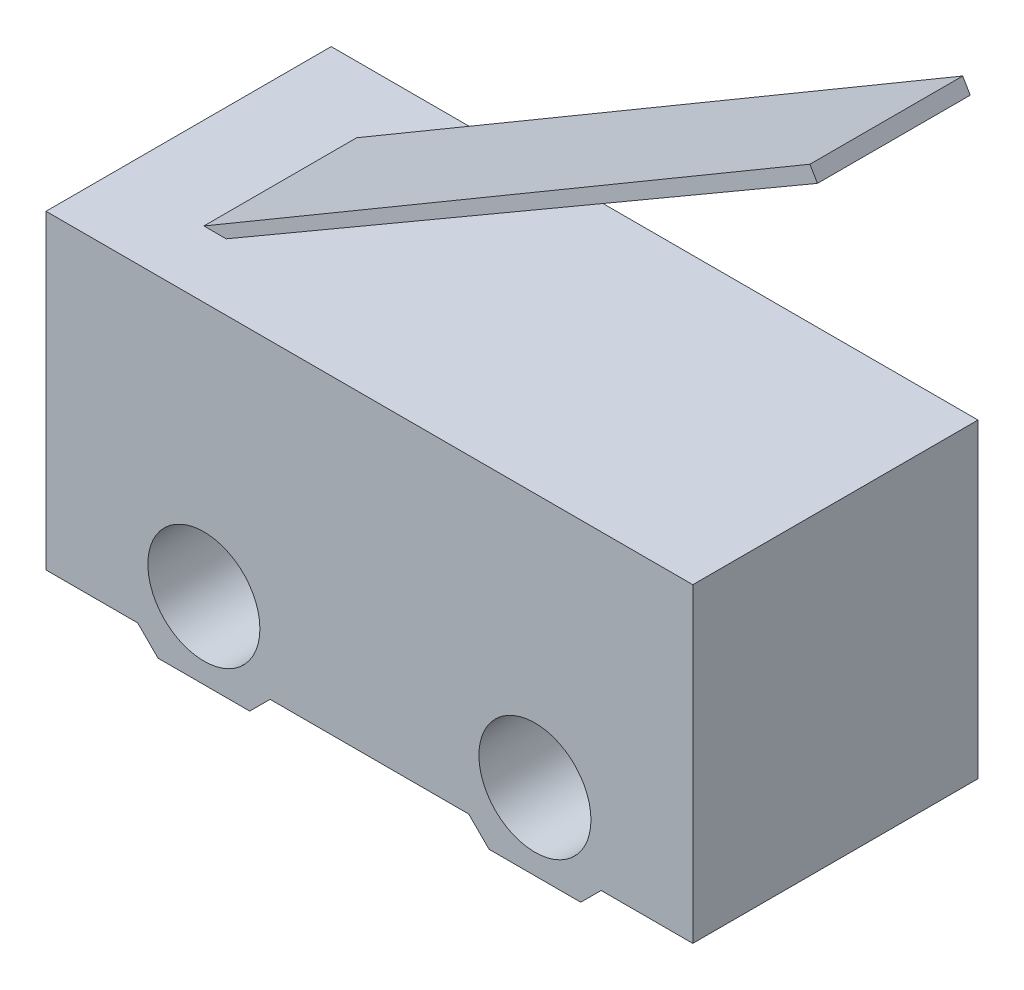
ISO-10303-21;
HEADER;
FILE_DESCRIPTION(('STEP AP214'),'2;1');
FILE_NAME('part.step','',(''),(''),'','','');
FILE_SCHEMA(('AUTOMOTIVE_DESIGN { 1 0 10303 214 1 1 1 1 }'));
ENDSEC;
DATA;
#1=APPLICATION_CONTEXT('core data for automotive mechanical design processes');
#2=APPLICATION_PROTOCOL_DEFINITION('international standard','automotive_design',2000,#1);
#3=PRODUCT_CONTEXT('',#1,'mechanical');
#4=PRODUCT('Part','Part','',(#3));
#5=PRODUCT_RELATED_PRODUCT_CATEGORY('part','',(#4));
#6=PRODUCT_DEFINITION_FORMATION('','',#4);
#7=PRODUCT_DEFINITION_CONTEXT('part definition',#1,'design');
#8=PRODUCT_DEFINITION('design','',#6,#7);
#9=PRODUCT_DEFINITION_SHAPE('','',#8);
#10=(LENGTH_UNIT() NAMED_UNIT(*) SI_UNIT(.MILLI.,.METRE.));
#11=(NAMED_UNIT(*) PLANE_ANGLE_UNIT() SI_UNIT($,.RADIAN.));
#12=(NAMED_UNIT(*) SI_UNIT($,.STERADIAN.) SOLID_ANGLE_UNIT());
#13=UNCERTAINTY_MEASURE_WITH_UNIT(LENGTH_MEASURE(1.E-05),#10,'distance_accuracy_value','');
#14=(GEOMETRIC_REPRESENTATION_CONTEXT(3) GLOBAL_UNCERTAINTY_ASSIGNED_CONTEXT((#13)) GLOBAL_UNIT_ASSIGNED_CONTEXT((#10,
#11,#12)) REPRESENTATION_CONTEXT('',''));
#15=CARTESIAN_POINT('',(0.,0.,0.));
#16=DIRECTION('',(0.,0.,1.));
#17=DIRECTION('',(1.,0.,0.));
#18=AXIS2_PLACEMENT_3D('',#15,#16,#17);
#19=CARTESIAN_POINT('',(0.,6.5,5.6));
#20=DIRECTION('',(0.,-1.,0.));
#21=DIRECTION('',(0.,0.,-1.));
#22=AXIS2_PLACEMENT_3D('',#19,#20,#21);
#23=PLANE('',#22);
#24=DIRECTION('',(-1.,0.,0.));
#25=VECTOR('',#24,1.);
#26=CARTESIAN_POINT('',(0.,6.5,0.));
#27=LINE('',#26,#25);
#28=CARTESIAN_POINT('',(12.7,6.5,0.));
#29=VERTEX_POINT('',#28);
#30=CARTESIAN_POINT('',(0.,6.5,0.));
#31=VERTEX_POINT('',#30);
#32=EDGE_CURVE('E223',#29,#31,#27,.T.);
#33=ORIENTED_EDGE('',*,*,#32,.T.);
#34=DIRECTION('',(0.,0.,-1.));
#35=VECTOR('',#34,1.);
#36=CARTESIAN_POINT('',(0.,6.5,5.6));
#37=LINE('',#36,#35);
#38=CARTESIAN_POINT('',(0.,6.5,5.6));
#39=VERTEX_POINT('',#38);
#40=EDGE_CURVE('E193',#39,#31,#37,.T.);
#41=ORIENTED_EDGE('',*,*,#40,.F.);
#42=DIRECTION('',(-1.,0.,0.));
#43=VECTOR('',#42,1.);
#44=CARTESIAN_POINT('',(0.,6.5,5.6));
#45=LINE('',#44,#43);
#46=CARTESIAN_POINT('',(12.7,6.5,5.6));
#47=VERTEX_POINT('',#46);
#48=EDGE_CURVE('E503',#47,#39,#45,.T.);
#49=ORIENTED_EDGE('',*,*,#48,.F.);
#50=DIRECTION('',(0.,0.,-1.));
#51=VECTOR('',#50,1.);
#52=CARTESIAN_POINT('',(12.7,6.5,5.6));
#53=LINE('',#52,#51);
#54=EDGE_CURVE('E197',#47,#29,#53,.T.);
#55=ORIENTED_EDGE('',*,*,#54,.T.);
#56=EDGE_LOOP('',(#33,#41,#49,#55));
#57=FACE_BOUND('',#56,.T.);
#58=DIRECTION('',(1.,0.,0.));
#59=VECTOR('',#58,1.);
#60=CARTESIAN_POINT('',(2.2382876574409,6.5,4.3));
#61=LINE('',#60,#59);
#62=CARTESIAN_POINT('',(1.8,6.5,4.3));
#63=VERTEX_POINT('',#62);
#64=CARTESIAN_POINT('',(2.2382876574409,6.5,4.3));
#65=VERTEX_POINT('',#64);
#66=EDGE_CURVE('E467',#63,#65,#61,.T.);
#67=ORIENTED_EDGE('',*,*,#66,.F.);
#68=DIRECTION('',(0.,0.,-1.));
#69=VECTOR('',#68,1.);
#70=CARTESIAN_POINT('',(1.8,6.5,4.3));
#71=LINE('',#70,#69);
#72=CARTESIAN_POINT('',(1.8,6.5,1.3));
#73=VERTEX_POINT('',#72);
#74=EDGE_CURVE('E465',#63,#73,#71,.T.);
#75=ORIENTED_EDGE('',*,*,#74,.T.);
#76=DIRECTION('',(1.,0.,0.));
#77=VECTOR('',#76,1.);
#78=CARTESIAN_POINT('',(2.2382876574409,6.5,1.3));
#79=LINE('',#78,#77);
#80=CARTESIAN_POINT('',(2.2382876574409,6.5,1.3));
#81=VERTEX_POINT('',#80);
#82=EDGE_CURVE('E453',#73,#81,#79,.T.);
#83=ORIENTED_EDGE('',*,*,#82,.T.);
#84=DIRECTION('',(0.,0.,-1.));
#85=VECTOR('',#84,1.);
#86=CARTESIAN_POINT('',(2.2382876574409,6.5,4.3));
#87=LINE('',#86,#85);
#88=EDGE_CURVE('E57',#65,#81,#87,.T.);
#89=ORIENTED_EDGE('',*,*,#88,.F.);
#90=EDGE_LOOP('',(#67,#75,#83,#89));
#91=FACE_BOUND('',#90,.T.);
#92=ADVANCED_FACE('F41',(#57,#91),#23,.F.);
#93=CARTESIAN_POINT('',(5.24999999999994,-5.25,5.6));
#94=DIRECTION('',(0.707106781186544,-0.707106781186552,0.));
#95=DIRECTION('',(0.707106781186552,0.707106781186544,0.));
#96=AXIS2_PLACEMENT_3D('',#93,#94,#95);
#97=PLANE('',#96);
#98=DIRECTION('',(-0.707106781186552,-0.707106781186544,0.));
#99=VECTOR('',#98,1.);
#100=CARTESIAN_POINT('',(5.24999999999994,-5.25,0.));
#101=LINE('',#100,#99);
#102=CARTESIAN_POINT('',(10.9,0.4,0.));
#103=VERTEX_POINT('',#102);
#104=CARTESIAN_POINT('',(10.5,0.,0.));
#105=VERTEX_POINT('',#104);
#106=EDGE_CURVE('E219',#103,#105,#101,.T.);
#107=ORIENTED_EDGE('',*,*,#106,.F.);
#108=DIRECTION('',(0.,0.,-1.));
#109=VECTOR('',#108,1.);
#110=CARTESIAN_POINT('',(10.9,0.4,5.6));
#111=LINE('',#110,#109);
#112=CARTESIAN_POINT('',(10.9,0.4,5.6));
#113=VERTEX_POINT('',#112);
#114=EDGE_CURVE('E11',#113,#103,#111,.T.);
#115=ORIENTED_EDGE('',*,*,#114,.F.);
#116=DIRECTION('',(-0.707106781186552,-0.707106781186544,0.));
#117=VECTOR('',#116,1.);
#118=CARTESIAN_POINT('',(5.24999999999994,-5.25,5.6));
#119=LINE('',#118,#117);
#120=CARTESIAN_POINT('',(10.5,0.,5.6));
#121=VERTEX_POINT('',#120);
#122=EDGE_CURVE('E495',#113,#121,#119,.T.);
#123=ORIENTED_EDGE('',*,*,#122,.T.);
#124=DIRECTION('',(0.,0.,-1.));
#125=VECTOR('',#124,1.);
#126=CARTESIAN_POINT('',(10.5,0.,5.6));
#127=LINE('',#126,#125);
#128=EDGE_CURVE('E110',#121,#105,#127,.T.);
#129=ORIENTED_EDGE('',*,*,#128,.T.);
#130=EDGE_LOOP('',(#107,#115,#123,#129));
#131=FACE_BOUND('',#130,.T.);
#132=ADVANCED_FACE('F286',(#131),#97,.T.);
#133=CARTESIAN_POINT('',(0.,0.4,5.6));
#134=DIRECTION('',(0.,1.,0.));
#135=DIRECTION('',(-1.,0.,0.));
#136=AXIS2_PLACEMENT_3D('',#133,#134,#135);
#137=PLANE('',#136);
#138=DIRECTION('',(1.,0.,0.));
#139=VECTOR('',#138,1.);
#140=CARTESIAN_POINT('',(0.,0.4,0.));
#141=LINE('',#140,#139);
#142=CARTESIAN_POINT('',(12.7,0.4,0.));
#143=VERTEX_POINT('',#142);
#144=EDGE_CURVE('E214',#103,#143,#141,.T.);
#145=ORIENTED_EDGE('',*,*,#144,.T.);
#146=DIRECTION('',(0.,0.,-1.));
#147=VECTOR('',#146,1.);
#148=CARTESIAN_POINT('',(12.7,0.4,5.6));
#149=LINE('',#148,#147);
#150=CARTESIAN_POINT('',(12.7,0.4,5.6));
#151=VERTEX_POINT('',#150);
#152=EDGE_CURVE('E50',#151,#143,#149,.T.);
#153=ORIENTED_EDGE('',*,*,#152,.F.);
#154=DIRECTION('',(1.,0.,0.));
#155=VECTOR('',#154,1.);
#156=CARTESIAN_POINT('',(0.,0.4,5.6));
#157=LINE('',#156,#155);
#158=EDGE_CURVE('E498',#113,#151,#157,.T.);
#159=ORIENTED_EDGE('',*,*,#158,.F.);
#160=ORIENTED_EDGE('',*,*,#114,.T.);
#161=EDGE_LOOP('',(#145,#153,#159,#160));
#162=FACE_BOUND('',#161,.T.);
#163=ADVANCED_FACE('F215',(#162),#137,.F.);
#164=CARTESIAN_POINT('',(12.7,0.,5.6));
#165=DIRECTION('',(-1.,0.,0.));
#166=DIRECTION('',(0.,0.,1.));
#167=AXIS2_PLACEMENT_3D('',#164,#165,#166);
#168=PLANE('',#167);
#169=DIRECTION('',(0.,1.,0.));
#170=VECTOR('',#169,1.);
#171=CARTESIAN_POINT('',(12.7,0.,0.));
#172=LINE('',#171,#170);
#173=EDGE_CURVE('E208',#143,#29,#172,.T.);
#174=ORIENTED_EDGE('',*,*,#173,.T.);
#175=ORIENTED_EDGE('',*,*,#54,.F.);
#176=DIRECTION('',(0.,1.,0.));
#177=VECTOR('',#176,1.);
#178=CARTESIAN_POINT('',(12.7,0.,5.6));
#179=LINE('',#178,#177);
#180=EDGE_CURVE('E210',#151,#47,#179,.T.);
#181=ORIENTED_EDGE('',*,*,#180,.F.);
#182=ORIENTED_EDGE('',*,*,#152,.T.);
#183=EDGE_LOOP('',(#174,#175,#181,#182));
#184=FACE_BOUND('',#183,.T.);
#185=ADVANCED_FACE('F206',(#184),#168,.F.);
#186=CARTESIAN_POINT('',(0.,0.,5.6));
#187=DIRECTION('',(1.,0.,0.));
#188=DIRECTION('',(0.,0.,-1.));
#189=AXIS2_PLACEMENT_3D('',#186,#187,#188);
#190=PLANE('',#189);
#191=DIRECTION('',(0.,-1.,0.));
#192=VECTOR('',#191,1.);
#193=CARTESIAN_POINT('',(0.,0.,0.));
#194=LINE('',#193,#192);
#195=CARTESIAN_POINT('',(0.,0.4,0.));
#196=VERTEX_POINT('',#195);
#197=EDGE_CURVE('E232',#31,#196,#194,.T.);
#198=ORIENTED_EDGE('',*,*,#197,.T.);
#199=DIRECTION('',(0.,0.,-1.));
#200=VECTOR('',#199,1.);
#201=CARTESIAN_POINT('',(0.,0.4,5.6));
#202=LINE('',#201,#200);
#203=CARTESIAN_POINT('',(0.,0.4,5.6));
#204=VERTEX_POINT('',#203);
#205=EDGE_CURVE('E189',#204,#196,#202,.T.);
#206=ORIENTED_EDGE('',*,*,#205,.F.);
#207=DIRECTION('',(0.,-1.,0.));
#208=VECTOR('',#207,1.);
#209=CARTESIAN_POINT('',(0.,0.,5.6));
#210=LINE('',#209,#208);
#211=EDGE_CURVE('E507',#39,#204,#210,.T.);
#212=ORIENTED_EDGE('',*,*,#211,.F.);
#213=ORIENTED_EDGE('',*,*,#40,.T.);
#214=EDGE_LOOP('',(#198,#206,#212,#213));
#215=FACE_BOUND('',#214,.T.);
#216=ADVANCED_FACE('F295',(#215),#190,.F.);
#217=CARTESIAN_POINT('',(0.,0.4,5.6));
#218=DIRECTION('',(0.,1.,0.));
#219=DIRECTION('',(-1.,0.,0.));
#220=AXIS2_PLACEMENT_3D('',#217,#218,#219);
#221=PLANE('',#220);
#222=DIRECTION('',(1.,0.,0.));
#223=VECTOR('',#222,1.);
#224=CARTESIAN_POINT('',(0.,0.4,0.));
#225=LINE('',#224,#223);
#226=CARTESIAN_POINT('',(1.8,0.4,0.));
#227=VERTEX_POINT('',#226);
#228=EDGE_CURVE('E236',#196,#227,#225,.T.);
#229=ORIENTED_EDGE('',*,*,#228,.T.);
#230=DIRECTION('',(0.,0.,-1.));
#231=VECTOR('',#230,1.);
#232=CARTESIAN_POINT('',(1.8,0.4,5.6));
#233=LINE('',#232,#231);
#234=CARTESIAN_POINT('',(1.8,0.4,5.6));
#235=VERTEX_POINT('',#234);
#236=EDGE_CURVE('E185',#235,#227,#233,.T.);
#237=ORIENTED_EDGE('',*,*,#236,.F.);
#238=DIRECTION('',(1.,0.,0.));
#239=VECTOR('',#238,1.);
#240=CARTESIAN_POINT('',(0.,0.4,5.6));
#241=LINE('',#240,#239);
#242=EDGE_CURVE('E511',#204,#235,#241,.T.);
#243=ORIENTED_EDGE('',*,*,#242,.F.);
#244=ORIENTED_EDGE('',*,*,#205,.T.);
#245=EDGE_LOOP('',(#229,#237,#243,#244));
#246=FACE_BOUND('',#245,.T.);
#247=ADVANCED_FACE('F314',(#246),#221,.F.);
#248=CARTESIAN_POINT('',(1.10000000000001,1.1,5.6));
#249=DIRECTION('',(0.707106781186551,0.707106781186544,0.));
#250=DIRECTION('',(-0.707106781186544,0.707106781186551,0.));
#251=AXIS2_PLACEMENT_3D('',#248,#249,#250);
#252=PLANE('',#251);
#253=DIRECTION('',(0.707106781186544,-0.707106781186551,0.));
#254=VECTOR('',#253,1.);
#255=CARTESIAN_POINT('',(1.10000000000001,1.1,0.));
#256=LINE('',#255,#254);
#257=CARTESIAN_POINT('',(2.2,0.,0.));
#258=VERTEX_POINT('',#257);
#259=EDGE_CURVE('E240',#227,#258,#256,.T.);
#260=ORIENTED_EDGE('',*,*,#259,.T.);
#261=DIRECTION('',(0.,0.,-1.));
#262=VECTOR('',#261,1.);
#263=CARTESIAN_POINT('',(2.2,0.,5.6));
#264=LINE('',#263,#262);
#265=CARTESIAN_POINT('',(2.2,0.,5.6));
#266=VERTEX_POINT('',#265);
#267=EDGE_CURVE('E181',#266,#258,#264,.T.);
#268=ORIENTED_EDGE('',*,*,#267,.F.);
#269=DIRECTION('',(0.707106781186544,-0.707106781186551,0.));
#270=VECTOR('',#269,1.);
#271=CARTESIAN_POINT('',(1.10000000000001,1.1,5.6));
#272=LINE('',#271,#270);
#273=EDGE_CURVE('E515',#235,#266,#272,.T.);
#274=ORIENTED_EDGE('',*,*,#273,.F.);
#275=ORIENTED_EDGE('',*,*,#236,.T.);
#276=EDGE_LOOP('',(#260,#268,#274,#275));
#277=FACE_BOUND('',#276,.T.);
#278=ADVANCED_FACE('F321',(#277),#252,.F.);
#279=CARTESIAN_POINT('',(0.,0.,5.6));
#280=DIRECTION('',(0.,1.,0.));
#281=DIRECTION('',(-1.,0.,0.));
#282=AXIS2_PLACEMENT_3D('',#279,#280,#281);
#283=PLANE('',#282);
#284=DIRECTION('',(1.,0.,0.));
#285=VECTOR('',#284,1.);
#286=CARTESIAN_POINT('',(0.,0.,0.));
#287=LINE('',#286,#285);
#288=CARTESIAN_POINT('',(4.,0.,0.));
#289=VERTEX_POINT('',#288);
#290=EDGE_CURVE('E244',#258,#289,#287,.T.);
#291=ORIENTED_EDGE('',*,*,#290,.T.);
#292=DIRECTION('',(0.,0.,-1.));
#293=VECTOR('',#292,1.);
#294=CARTESIAN_POINT('',(4.,0.,5.6));
#295=LINE('',#294,#293);
#296=CARTESIAN_POINT('',(4.,0.,5.6));
#297=VERTEX_POINT('',#296);
#298=EDGE_CURVE('E174',#297,#289,#295,.T.);
#299=ORIENTED_EDGE('',*,*,#298,.F.);
#300=DIRECTION('',(1.,0.,0.));
#301=VECTOR('',#300,1.);
#302=CARTESIAN_POINT('',(0.,0.,5.6));
#303=LINE('',#302,#301);
#304=EDGE_CURVE('E519',#266,#297,#303,.T.);
#305=ORIENTED_EDGE('',*,*,#304,.F.);
#306=ORIENTED_EDGE('',*,*,#267,.T.);
#307=EDGE_LOOP('',(#291,#299,#305,#306));
#308=FACE_BOUND('',#307,.T.);
#309=ADVANCED_FACE('F328',(#308),#283,.F.);
#310=CARTESIAN_POINT('',(1.99999999999998,-2.,5.6));
#311=DIRECTION('',(0.707106781186544,-0.707106781186552,0.));
#312=DIRECTION('',(0.707106781186552,0.707106781186544,0.));
#313=AXIS2_PLACEMENT_3D('',#310,#311,#312);
#314=PLANE('',#313);
#315=DIRECTION('',(-0.707106781186552,-0.707106781186544,0.));
#316=VECTOR('',#315,1.);
#317=CARTESIAN_POINT('',(1.99999999999998,-2.,0.));
#318=LINE('',#317,#316);
#319=CARTESIAN_POINT('',(4.4,0.399999999999998,0.));
#320=VERTEX_POINT('',#319);
#321=EDGE_CURVE('E248',#320,#289,#318,.T.);
#322=ORIENTED_EDGE('',*,*,#321,.F.);
#323=DIRECTION('',(0.,0.,-1.));
#324=VECTOR('',#323,1.);
#325=CARTESIAN_POINT('',(4.4,0.399999999999998,5.6));
#326=LINE('',#325,#324);
#327=CARTESIAN_POINT('',(4.4,0.399999999999998,5.6));
#328=VERTEX_POINT('',#327);
#329=EDGE_CURVE('E170',#328,#320,#326,.T.);
#330=ORIENTED_EDGE('',*,*,#329,.F.);
#331=DIRECTION('',(-0.707106781186552,-0.707106781186544,0.));
#332=VECTOR('',#331,1.);
#333=CARTESIAN_POINT('',(1.99999999999998,-2.,5.6));
#334=LINE('',#333,#332);
#335=EDGE_CURVE('E162',#328,#297,#334,.T.);
#336=ORIENTED_EDGE('',*,*,#335,.T.);
#337=ORIENTED_EDGE('',*,*,#298,.T.);
#338=EDGE_LOOP('',(#322,#330,#336,#337));
#339=FACE_BOUND('',#338,.T.);
#340=ADVANCED_FACE('F336',(#339),#314,.T.);
#341=CARTESIAN_POINT('',(0.,0.399999999999997,5.6));
#342=DIRECTION('',(0.,1.,0.));
#343=DIRECTION('',(-1.,0.,0.));
#344=AXIS2_PLACEMENT_3D('',#341,#342,#343);
#345=PLANE('',#344);
#346=DIRECTION('',(1.,0.,0.));
#347=VECTOR('',#346,1.);
#348=CARTESIAN_POINT('',(0.,0.399999999999997,0.));
#349=LINE('',#348,#347);
#350=CARTESIAN_POINT('',(8.3,0.399999999999998,0.));
#351=VERTEX_POINT('',#350);
#352=EDGE_CURVE('E168',#320,#351,#349,.T.);
#353=ORIENTED_EDGE('',*,*,#352,.T.);
#354=DIRECTION('',(0.,0.,-1.));
#355=VECTOR('',#354,1.);
#356=CARTESIAN_POINT('',(8.3,0.399999999999998,5.6));
#357=LINE('',#356,#355);
#358=CARTESIAN_POINT('',(8.3,0.399999999999998,5.6));
#359=VERTEX_POINT('',#358);
#360=EDGE_CURVE('E151',#359,#351,#357,.T.);
#361=ORIENTED_EDGE('',*,*,#360,.F.);
#362=DIRECTION('',(1.,0.,0.));
#363=VECTOR('',#362,1.);
#364=CARTESIAN_POINT('',(0.,0.399999999999997,5.6));
#365=LINE('',#364,#363);
#366=EDGE_CURVE('E156',#328,#359,#365,.T.);
#367=ORIENTED_EDGE('',*,*,#366,.F.);
#368=ORIENTED_EDGE('',*,*,#329,.T.);
#369=EDGE_LOOP('',(#353,#361,#367,#368));
#370=FACE_BOUND('',#369,.T.);
#371=ADVANCED_FACE('F166',(#370),#345,.F.);
#372=CARTESIAN_POINT('',(4.35000000000001,4.35,5.6));
#373=DIRECTION('',(0.707106781186548,0.707106781186547,0.));
#374=DIRECTION('',(-0.707106781186547,0.707106781186548,0.));
#375=AXIS2_PLACEMENT_3D('',#372,#373,#374);
#376=PLANE('',#375);
#377=DIRECTION('',(0.707106781186547,-0.707106781186548,0.));
#378=VECTOR('',#377,1.);
#379=CARTESIAN_POINT('',(4.35000000000001,4.35,0.));
#380=LINE('',#379,#378);
#381=CARTESIAN_POINT('',(8.7,0.,0.));
#382=VERTEX_POINT('',#381);
#383=EDGE_CURVE('E254',#351,#382,#380,.T.);
#384=ORIENTED_EDGE('',*,*,#383,.T.);
#385=DIRECTION('',(0.,0.,-1.));
#386=VECTOR('',#385,1.);
#387=CARTESIAN_POINT('',(8.7,0.,5.6));
#388=LINE('',#387,#386);
#389=CARTESIAN_POINT('',(8.7,0.,5.6));
#390=VERTEX_POINT('',#389);
#391=EDGE_CURVE('E154',#390,#382,#388,.T.);
#392=ORIENTED_EDGE('',*,*,#391,.F.);
#393=DIRECTION('',(0.707106781186547,-0.707106781186548,0.));
#394=VECTOR('',#393,1.);
#395=CARTESIAN_POINT('',(4.35000000000001,4.35,5.6));
#396=LINE('',#395,#394);
#397=EDGE_CURVE('E146',#359,#390,#396,.T.);
#398=ORIENTED_EDGE('',*,*,#397,.F.);
#399=ORIENTED_EDGE('',*,*,#360,.T.);
#400=EDGE_LOOP('',(#384,#392,#398,#399));
#401=FACE_BOUND('',#400,.T.);
#402=ADVANCED_FACE('F149',(#401),#376,.F.);
#403=CARTESIAN_POINT('',(3.1,1.5,5.6));
#404=DIRECTION('',(0.,0.,-1.));
#405=DIRECTION('',(-1.,0.,0.));
#406=AXIS2_PLACEMENT_3D('',#403,#404,#405);
#407=CYLINDRICAL_SURFACE('',#406,1.1);
#408=CARTESIAN_POINT('',(3.1,1.5,5.6));
#409=DIRECTION('',(0.,0.,1.));
#410=DIRECTION('',(1.,0.,0.));
#411=AXIS2_PLACEMENT_3D('',#408,#409,#410);
#412=CIRCLE('',#411,1.1);
#413=CARTESIAN_POINT('',(4.2,1.5,5.6));
#414=VERTEX_POINT('',#413);
#415=EDGE_CURVE('E492',#414,#414,#412,.T.);
#416=ORIENTED_EDGE('',*,*,#415,.T.);
#417=EDGE_LOOP('',(#416));
#418=FACE_BOUND('',#417,.T.);
#419=CARTESIAN_POINT('',(3.1,1.5,0.));
#420=DIRECTION('',(0.,0.,1.));
#421=DIRECTION('',(1.,0.,0.));
#422=AXIS2_PLACEMENT_3D('',#419,#420,#421);
#423=CIRCLE('',#422,1.1);
#424=CARTESIAN_POINT('',(4.2,1.5,0.));
#425=VERTEX_POINT('',#424);
#426=EDGE_CURVE('E225',#425,#425,#423,.T.);
#427=ORIENTED_EDGE('',*,*,#426,.F.);
#428=EDGE_LOOP('',(#427));
#429=FACE_BOUND('',#428,.T.);
#430=ADVANCED_FACE('F273',(#418,#429),#407,.F.);
#431=CARTESIAN_POINT('',(9.6,1.5,5.6));
#432=DIRECTION('',(0.,0.,-1.));
#433=DIRECTION('',(-1.,0.,0.));
#434=AXIS2_PLACEMENT_3D('',#431,#432,#433);
#435=CYLINDRICAL_SURFACE('',#434,1.1);
#436=CARTESIAN_POINT('',(9.6,1.5,5.6));
#437=DIRECTION('',(0.,0.,1.));
#438=DIRECTION('',(1.,0.,0.));
#439=AXIS2_PLACEMENT_3D('',#436,#437,#438);
#440=CIRCLE('',#439,1.1);
#441=CARTESIAN_POINT('',(10.7,1.5,5.6));
#442=VERTEX_POINT('',#441);
#443=EDGE_CURVE('E259',#442,#442,#440,.T.);
#444=ORIENTED_EDGE('',*,*,#443,.T.);
#445=EDGE_LOOP('',(#444));
#446=FACE_BOUND('',#445,.T.);
#447=CARTESIAN_POINT('',(9.6,1.5,0.));
#448=DIRECTION('',(0.,0.,1.));
#449=DIRECTION('',(1.,0.,0.));
#450=AXIS2_PLACEMENT_3D('',#447,#448,#449);
#451=CIRCLE('',#450,1.1);
#452=CARTESIAN_POINT('',(10.7,1.5,0.));
#453=VERTEX_POINT('',#452);
#454=EDGE_CURVE('E264',#453,#453,#451,.T.);
#455=ORIENTED_EDGE('',*,*,#454,.F.);
#456=EDGE_LOOP('',(#455));
#457=FACE_BOUND('',#456,.T.);
#458=ADVANCED_FACE('F43',(#446,#457),#435,.F.);
#459=CARTESIAN_POINT('',(0.,0.,5.6));
#460=DIRECTION('',(0.,1.,0.));
#461=DIRECTION('',(-1.,0.,0.));
#462=AXIS2_PLACEMENT_3D('',#459,#460,#461);
#463=PLANE('',#462);
#464=DIRECTION('',(1.,0.,0.));
#465=VECTOR('',#464,1.);
#466=CARTESIAN_POINT('',(0.,0.,0.));
#467=LINE('',#466,#465);
#468=EDGE_CURVE('E257',#382,#105,#467,.T.);
#469=ORIENTED_EDGE('',*,*,#468,.T.);
#470=ORIENTED_EDGE('',*,*,#128,.F.);
#471=DIRECTION('',(1.,0.,0.));
#472=VECTOR('',#471,1.);
#473=CARTESIAN_POINT('',(0.,0.,5.6));
#474=LINE('',#473,#472);
#475=EDGE_CURVE('E66',#390,#121,#474,.T.);
#476=ORIENTED_EDGE('',*,*,#475,.F.);
#477=ORIENTED_EDGE('',*,*,#391,.T.);
#478=EDGE_LOOP('',(#469,#470,#476,#477));
#479=FACE_BOUND('',#478,.T.);
#480=ADVANCED_FACE('F280',(#479),#463,.F.);
#481=CARTESIAN_POINT('',(0.,0.,5.6));
#482=DIRECTION('',(0.,0.,1.));
#483=DIRECTION('',(1.,0.,0.));
#484=AXIS2_PLACEMENT_3D('',#481,#482,#483);
#485=PLANE('',#484);
#486=ORIENTED_EDGE('',*,*,#443,.F.);
#487=EDGE_LOOP('',(#486));
#488=FACE_BOUND('',#487,.T.);
#489=ORIENTED_EDGE('',*,*,#415,.F.);
#490=EDGE_LOOP('',(#489));
#491=FACE_BOUND('',#490,.T.);
#492=ORIENTED_EDGE('',*,*,#122,.F.);
#493=ORIENTED_EDGE('',*,*,#158,.T.);
#494=ORIENTED_EDGE('',*,*,#180,.T.);
#495=ORIENTED_EDGE('',*,*,#48,.T.);
#496=ORIENTED_EDGE('',*,*,#211,.T.);
#497=ORIENTED_EDGE('',*,*,#242,.T.);
#498=ORIENTED_EDGE('',*,*,#273,.T.);
#499=ORIENTED_EDGE('',*,*,#304,.T.);
#500=ORIENTED_EDGE('',*,*,#335,.F.);
#501=ORIENTED_EDGE('',*,*,#366,.T.);
#502=ORIENTED_EDGE('',*,*,#397,.T.);
#503=ORIENTED_EDGE('',*,*,#475,.T.);
#504=EDGE_LOOP('',(#492,#493,#494,#495,#496,#497,#498,#499,#500,#501,#502,#503));
#505=FACE_BOUND('',#504,.T.);
#506=ADVANCED_FACE('F160',(#488,#491,#505),#485,.T.);
#507=CARTESIAN_POINT('',(0.,0.,0.));
#508=DIRECTION('',(0.,0.,1.));
#509=DIRECTION('',(1.,0.,0.));
#510=AXIS2_PLACEMENT_3D('',#507,#508,#509);
#511=PLANE('',#510);
#512=ORIENTED_EDGE('',*,*,#454,.T.);
#513=EDGE_LOOP('',(#512));
#514=FACE_BOUND('',#513,.T.);
#515=ORIENTED_EDGE('',*,*,#426,.T.);
#516=EDGE_LOOP('',(#515));
#517=FACE_BOUND('',#516,.T.);
#518=ORIENTED_EDGE('',*,*,#106,.T.);
#519=ORIENTED_EDGE('',*,*,#468,.F.);
#520=ORIENTED_EDGE('',*,*,#383,.F.);
#521=ORIENTED_EDGE('',*,*,#352,.F.);
#522=ORIENTED_EDGE('',*,*,#321,.T.);
#523=ORIENTED_EDGE('',*,*,#290,.F.);
#524=ORIENTED_EDGE('',*,*,#259,.F.);
#525=ORIENTED_EDGE('',*,*,#228,.F.);
#526=ORIENTED_EDGE('',*,*,#197,.F.);
#527=ORIENTED_EDGE('',*,*,#32,.F.);
#528=ORIENTED_EDGE('',*,*,#173,.F.);
#529=ORIENTED_EDGE('',*,*,#144,.F.);
#530=EDGE_LOOP('',(#518,#519,#520,#521,#522,#523,#524,#525,#526,#527,#528,#529));
#531=FACE_BOUND('',#530,.T.);
#532=ADVANCED_FACE('F271',(#514,#517,#531),#511,.F.);
#533=CARTESIAN_POINT('',(2.2382876574409,6.5,4.3));
#534=DIRECTION('',(-0.50250012008132,0.864577139021301,0.));
#535=DIRECTION('',(-0.864577139021302,-0.50250012008132,0.));
#536=AXIS2_PLACEMENT_3D('',#533,#534,#535);
#537=PLANE('',#536);
#538=DIRECTION('',(0.864577139021301,0.50250012008132,0.));
#539=VECTOR('',#538,1.);
#540=CARTESIAN_POINT('',(2.2382876574409,6.5,1.3));
#541=LINE('',#540,#539);
#542=CARTESIAN_POINT('',(13.8483196900664,13.2478565268871,1.3));
#543=VERTEX_POINT('',#542);
#544=EDGE_CURVE('E459',#81,#543,#541,.T.);
#545=ORIENTED_EDGE('',*,*,#544,.T.);
#546=DIRECTION('',(0.,0.,-1.));
#547=VECTOR('',#546,1.);
#548=CARTESIAN_POINT('',(13.8483196900664,13.2478565268871,4.3));
#549=LINE('',#548,#547);
#550=CARTESIAN_POINT('',(13.8483196900664,13.2478565268871,4.3));
#551=VERTEX_POINT('',#550);
#552=EDGE_CURVE('E476',#551,#543,#549,.T.);
#553=ORIENTED_EDGE('',*,*,#552,.F.);
#554=DIRECTION('',(0.864577139021301,0.50250012008132,0.));
#555=VECTOR('',#554,1.);
#556=CARTESIAN_POINT('',(2.2382876574409,6.5,4.3));
#557=LINE('',#556,#555);
#558=EDGE_CURVE('E550',#65,#551,#557,.T.);
#559=ORIENTED_EDGE('',*,*,#558,.F.);
#560=ORIENTED_EDGE('',*,*,#88,.T.);
#561=EDGE_LOOP('',(#545,#553,#559,#560));
#562=FACE_BOUND('',#561,.T.);
#563=ADVANCED_FACE('F391',(#562),#537,.F.);
#564=CARTESIAN_POINT('',(13.8483196900664,13.2478565268871,4.3));
#565=DIRECTION('',(-0.86193421515777,-0.507020126563392,0.));
#566=DIRECTION('',(0.507020126563393,-0.86193421515777,0.));
#567=AXIS2_PLACEMENT_3D('',#564,#565,#566);
#568=PLANE('',#567);
#569=DIRECTION('',(-0.507020126563393,0.86193421515777,0.));
#570=VECTOR('',#569,1.);
#571=CARTESIAN_POINT('',(13.8483196900664,13.2478565268871,1.3));
#572=LINE('',#571,#570);
#573=CARTESIAN_POINT('',(13.7,13.5,1.3));
#574=VERTEX_POINT('',#573);
#575=EDGE_CURVE('E539',#543,#574,#572,.T.);
#576=ORIENTED_EDGE('',*,*,#575,.T.);
#577=DIRECTION('',(0.,0.,-1.));
#578=VECTOR('',#577,1.);
#579=CARTESIAN_POINT('',(13.7,13.5,4.3));
#580=LINE('',#579,#578);
#581=CARTESIAN_POINT('',(13.7,13.5,4.3));
#582=VERTEX_POINT('',#581);
#583=EDGE_CURVE('E470',#582,#574,#580,.T.);
#584=ORIENTED_EDGE('',*,*,#583,.F.);
#585=DIRECTION('',(-0.507020126563393,0.86193421515777,0.));
#586=VECTOR('',#585,1.);
#587=CARTESIAN_POINT('',(13.8483196900664,13.2478565268871,4.3));
#588=LINE('',#587,#586);
#589=EDGE_CURVE('E479',#551,#582,#588,.T.);
#590=ORIENTED_EDGE('',*,*,#589,.F.);
#591=ORIENTED_EDGE('',*,*,#552,.T.);
#592=EDGE_LOOP('',(#576,#584,#590,#591));
#593=FACE_BOUND('',#592,.T.);
#594=ADVANCED_FACE('F407',(#593),#568,.F.);
#595=CARTESIAN_POINT('',(1.8,6.5,4.3));
#596=DIRECTION('',(0.507020126563394,-0.861934215157769,0.));
#597=DIRECTION('',(0.86193421515777,0.507020126563394,0.));
#598=AXIS2_PLACEMENT_3D('',#595,#596,#597);
#599=PLANE('',#598);
#600=DIRECTION('',(-0.86193421515777,-0.507020126563394,0.));
#601=VECTOR('',#600,1.);
#602=CARTESIAN_POINT('',(1.8,6.5,1.3));
#603=LINE('',#602,#601);
#604=EDGE_CURVE('E458',#574,#73,#603,.T.);
#605=ORIENTED_EDGE('',*,*,#604,.T.);
#606=ORIENTED_EDGE('',*,*,#74,.F.);
#607=DIRECTION('',(-0.86193421515777,-0.507020126563394,0.));
#608=VECTOR('',#607,1.);
#609=CARTESIAN_POINT('',(1.8,6.5,4.3));
#610=LINE('',#609,#608);
#611=EDGE_CURVE('E471',#582,#63,#610,.T.);
#612=ORIENTED_EDGE('',*,*,#611,.F.);
#613=ORIENTED_EDGE('',*,*,#583,.T.);
#614=EDGE_LOOP('',(#605,#606,#612,#613));
#615=FACE_BOUND('',#614,.T.);
#616=ADVANCED_FACE('F416',(#615),#599,.F.);
#617=CARTESIAN_POINT('',(0.,0.,4.3));
#618=DIRECTION('',(0.,0.,-1.));
#619=DIRECTION('',(-1.,0.,0.));
#620=AXIS2_PLACEMENT_3D('',#617,#618,#619);
#621=PLANE('',#620);
#622=ORIENTED_EDGE('',*,*,#66,.T.);
#623=ORIENTED_EDGE('',*,*,#558,.T.);
#624=ORIENTED_EDGE('',*,*,#589,.T.);
#625=ORIENTED_EDGE('',*,*,#611,.T.);
#626=EDGE_LOOP('',(#622,#623,#624,#625));
#627=FACE_BOUND('',#626,.T.);
#628=ADVANCED_FACE('F426',(#627),#621,.F.);
#629=CARTESIAN_POINT('',(0.,0.,1.3));
#630=DIRECTION('',(0.,0.,-1.));
#631=DIRECTION('',(-1.,0.,0.));
#632=AXIS2_PLACEMENT_3D('',#629,#630,#631);
#633=PLANE('',#632);
#634=ORIENTED_EDGE('',*,*,#82,.F.);
#635=ORIENTED_EDGE('',*,*,#604,.F.);
#636=ORIENTED_EDGE('',*,*,#575,.F.);
#637=ORIENTED_EDGE('',*,*,#544,.F.);
#638=EDGE_LOOP('',(#634,#635,#636,#637));
#639=FACE_BOUND('',#638,.T.);
#640=ADVANCED_FACE('F436',(#639),#633,.T.);
#641=CLOSED_SHELL('',(#92,#132,#163,#185,#216,#247,#278,#309,#340,#371,#402,#430,#458,#480,#506,
#532,#563,#594,#616,#628,#640));
#642=MANIFOLD_SOLID_BREP('B2',#641);
#643=ADVANCED_BREP_SHAPE_REPRESENTATION('',(#18,#642),#14);
#644=SHAPE_DEFINITION_REPRESENTATION(#9,#643);
ENDSEC;
END-ISO-10303-21;
